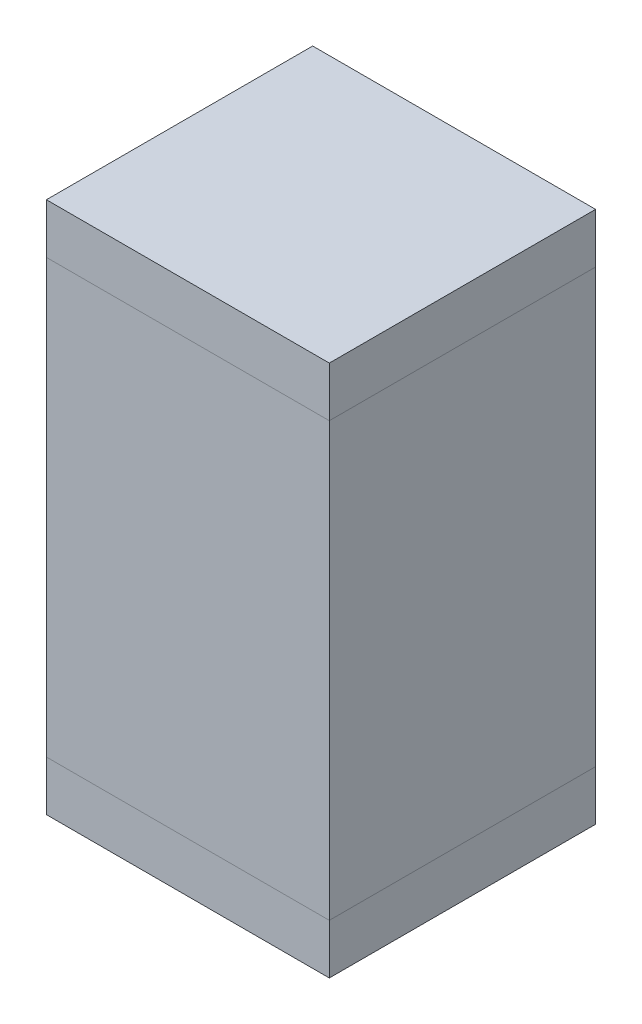
ISO-10303-21;
HEADER;
FILE_DESCRIPTION(('STEP AP214'),'2;1');
FILE_NAME('part.step','',(''),(''),'','','');
FILE_SCHEMA(('AUTOMOTIVE_DESIGN { 1 0 10303 214 1 1 1 1 }'));
ENDSEC;
DATA;
#1=APPLICATION_CONTEXT('core data for automotive mechanical design processes');
#2=APPLICATION_PROTOCOL_DEFINITION('international standard','automotive_design',2000,#1);
#3=PRODUCT_CONTEXT('',#1,'mechanical');
#4=PRODUCT('Part','Part','',(#3));
#5=PRODUCT_RELATED_PRODUCT_CATEGORY('part','',(#4));
#6=PRODUCT_DEFINITION_FORMATION('','',#4);
#7=PRODUCT_DEFINITION_CONTEXT('part definition',#1,'design');
#8=PRODUCT_DEFINITION('design','',#6,#7);
#9=PRODUCT_DEFINITION_SHAPE('','',#8);
#10=(LENGTH_UNIT() NAMED_UNIT(*) SI_UNIT(.MILLI.,.METRE.));
#11=(NAMED_UNIT(*) PLANE_ANGLE_UNIT() SI_UNIT($,.RADIAN.));
#12=(NAMED_UNIT(*) SI_UNIT($,.STERADIAN.) SOLID_ANGLE_UNIT());
#13=UNCERTAINTY_MEASURE_WITH_UNIT(LENGTH_MEASURE(1.E-05),#10,'distance_accuracy_value','');
#14=(GEOMETRIC_REPRESENTATION_CONTEXT(3) GLOBAL_UNCERTAINTY_ASSIGNED_CONTEXT((#13)) GLOBAL_UNIT_ASSIGNED_CONTEXT((#10,
#11,#12)) REPRESENTATION_CONTEXT('',''));
#15=CARTESIAN_POINT('',(0.,0.,0.));
#16=DIRECTION('',(0.,0.,1.));
#17=DIRECTION('',(1.,0.,0.));
#18=AXIS2_PLACEMENT_3D('',#15,#16,#17);
#19=CARTESIAN_POINT('',(0.,0.,0.));
#20=DIRECTION('',(0.,0.,1.));
#21=DIRECTION('',(1.,0.,0.));
#22=AXIS2_PLACEMENT_3D('',#19,#20,#21);
#23=PLANE('',#22);
#24=DIRECTION('',(1.,0.,0.));
#25=VECTOR('',#24,1.);
#26=CARTESIAN_POINT('',(-0.425,0.65,0.));
#27=LINE('',#26,#25);
#28=CARTESIAN_POINT('',(-0.425,0.65,0.));
#29=VERTEX_POINT('',#28);
#30=CARTESIAN_POINT('',(0.425,0.65,0.));
#31=VERTEX_POINT('',#30);
#32=EDGE_CURVE('P0_E26',#29,#31,#27,.T.);
#33=ORIENTED_EDGE('',*,*,#32,.T.);
#34=DIRECTION('',(0.,-1.,0.));
#35=VECTOR('',#34,1.);
#36=CARTESIAN_POINT('',(0.425,0.65,0.));
#37=LINE('',#36,#35);
#38=CARTESIAN_POINT('',(0.425,-0.65,0.));
#39=VERTEX_POINT('',#38);
#40=EDGE_CURVE('P0_E87',#31,#39,#37,.T.);
#41=ORIENTED_EDGE('',*,*,#40,.T.);
#42=DIRECTION('',(-1.,0.,0.));
#43=VECTOR('',#42,1.);
#44=CARTESIAN_POINT('',(0.425,-0.65,0.));
#45=LINE('',#44,#43);
#46=CARTESIAN_POINT('',(-0.425,-0.65,0.));
#47=VERTEX_POINT('',#46);
#48=EDGE_CURVE('P0_E80',#39,#47,#45,.T.);
#49=ORIENTED_EDGE('',*,*,#48,.T.);
#50=DIRECTION('',(0.,1.,0.));
#51=VECTOR('',#50,1.);
#52=CARTESIAN_POINT('',(-0.425,-0.65,0.));
#53=LINE('',#52,#51);
#54=EDGE_CURVE('P0_E65',#47,#29,#53,.T.);
#55=ORIENTED_EDGE('',*,*,#54,.T.);
#56=EDGE_LOOP('',(#33,#41,#49,#55));
#57=FACE_BOUND('',#56,.T.);
#58=ADVANCED_FACE('P0_F17',(#57),#23,.F.);
#59=CARTESIAN_POINT('',(0.,0.,0.8));
#60=DIRECTION('',(0.,0.,1.));
#61=DIRECTION('',(1.,0.,0.));
#62=AXIS2_PLACEMENT_3D('',#59,#60,#61);
#63=PLANE('',#62);
#64=DIRECTION('',(-1.,0.,0.));
#65=VECTOR('',#64,1.);
#66=CARTESIAN_POINT('',(-0.425,0.65,0.8));
#67=LINE('',#66,#65);
#68=CARTESIAN_POINT('',(0.425,0.65,0.8));
#69=VERTEX_POINT('',#68);
#70=CARTESIAN_POINT('',(-0.425,0.65,0.8));
#71=VERTEX_POINT('',#70);
#72=EDGE_CURVE('P0_E11',#69,#71,#67,.T.);
#73=ORIENTED_EDGE('',*,*,#72,.T.);
#74=DIRECTION('',(0.,-1.,0.));
#75=VECTOR('',#74,1.);
#76=CARTESIAN_POINT('',(-0.425,-0.65,0.8));
#77=LINE('',#76,#75);
#78=CARTESIAN_POINT('',(-0.425,-0.65,0.8));
#79=VERTEX_POINT('',#78);
#80=EDGE_CURVE('P0_E75',#71,#79,#77,.T.);
#81=ORIENTED_EDGE('',*,*,#80,.T.);
#82=DIRECTION('',(1.,0.,0.));
#83=VECTOR('',#82,1.);
#84=CARTESIAN_POINT('',(0.425,-0.65,0.8));
#85=LINE('',#84,#83);
#86=CARTESIAN_POINT('',(0.425,-0.65,0.8));
#87=VERTEX_POINT('',#86);
#88=EDGE_CURVE('P0_E82',#79,#87,#85,.T.);
#89=ORIENTED_EDGE('',*,*,#88,.T.);
#90=DIRECTION('',(0.,1.,0.));
#91=VECTOR('',#90,1.);
#92=CARTESIAN_POINT('',(0.425,0.65,0.8));
#93=LINE('',#92,#91);
#94=EDGE_CURVE('P0_E95',#87,#69,#93,.T.);
#95=ORIENTED_EDGE('',*,*,#94,.T.);
#96=EDGE_LOOP('',(#73,#81,#89,#95));
#97=FACE_BOUND('',#96,.T.);
#98=ADVANCED_FACE('P0_F119',(#97),#63,.T.);
#99=CARTESIAN_POINT('',(0.425,0.65,0.));
#100=DIRECTION('',(0.,1.,0.));
#101=DIRECTION('',(1.,0.,0.));
#102=AXIS2_PLACEMENT_3D('',#99,#100,#101);
#103=PLANE('',#102);
#104=ORIENTED_EDGE('',*,*,#32,.F.);
#105=DIRECTION('',(0.,0.,1.));
#106=VECTOR('',#105,1.);
#107=CARTESIAN_POINT('',(-0.425,0.65,0.));
#108=LINE('',#107,#106);
#109=EDGE_CURVE('P0_E71',#29,#71,#108,.T.);
#110=ORIENTED_EDGE('',*,*,#109,.T.);
#111=ORIENTED_EDGE('',*,*,#72,.F.);
#112=DIRECTION('',(0.,0.,1.));
#113=VECTOR('',#112,1.);
#114=CARTESIAN_POINT('',(0.425,0.65,0.));
#115=LINE('',#114,#113);
#116=EDGE_CURVE('P0_E105',#31,#69,#115,.T.);
#117=ORIENTED_EDGE('',*,*,#116,.F.);
#118=EDGE_LOOP('',(#104,#110,#111,#117));
#119=FACE_BOUND('',#118,.T.);
#120=ADVANCED_FACE('P0_F106',(#119),#103,.T.);
#121=CARTESIAN_POINT('',(-0.425,0.65,0.));
#122=DIRECTION('',(-1.,0.,0.));
#123=DIRECTION('',(0.,0.,1.));
#124=AXIS2_PLACEMENT_3D('',#121,#122,#123);
#125=PLANE('',#124);
#126=ORIENTED_EDGE('',*,*,#54,.F.);
#127=DIRECTION('',(0.,0.,1.));
#128=VECTOR('',#127,1.);
#129=CARTESIAN_POINT('',(-0.425,-0.65,0.));
#130=LINE('',#129,#128);
#131=EDGE_CURVE('P0_E69',#47,#79,#130,.T.);
#132=ORIENTED_EDGE('',*,*,#131,.T.);
#133=ORIENTED_EDGE('',*,*,#80,.F.);
#134=ORIENTED_EDGE('',*,*,#109,.F.);
#135=EDGE_LOOP('',(#126,#132,#133,#134));
#136=FACE_BOUND('',#135,.T.);
#137=ADVANCED_FACE('P0_F67',(#136),#125,.T.);
#138=CARTESIAN_POINT('',(-0.425,-0.65,0.));
#139=DIRECTION('',(0.,-1.,0.));
#140=DIRECTION('',(0.,0.,-1.));
#141=AXIS2_PLACEMENT_3D('',#138,#139,#140);
#142=PLANE('',#141);
#143=ORIENTED_EDGE('',*,*,#48,.F.);
#144=DIRECTION('',(0.,0.,1.));
#145=VECTOR('',#144,1.);
#146=CARTESIAN_POINT('',(0.425,-0.65,0.));
#147=LINE('',#146,#145);
#148=EDGE_CURVE('P0_E89',#39,#87,#147,.T.);
#149=ORIENTED_EDGE('',*,*,#148,.T.);
#150=ORIENTED_EDGE('',*,*,#88,.F.);
#151=ORIENTED_EDGE('',*,*,#131,.F.);
#152=EDGE_LOOP('',(#143,#149,#150,#151));
#153=FACE_BOUND('',#152,.T.);
#154=ADVANCED_FACE('P0_F78',(#153),#142,.T.);
#155=CARTESIAN_POINT('',(0.425,-0.65,0.));
#156=DIRECTION('',(1.,0.,0.));
#157=DIRECTION('',(0.,1.,0.));
#158=AXIS2_PLACEMENT_3D('',#155,#156,#157);
#159=PLANE('',#158);
#160=ORIENTED_EDGE('',*,*,#40,.F.);
#161=ORIENTED_EDGE('',*,*,#116,.T.);
#162=ORIENTED_EDGE('',*,*,#94,.F.);
#163=ORIENTED_EDGE('',*,*,#148,.F.);
#164=EDGE_LOOP('',(#160,#161,#162,#163));
#165=FACE_BOUND('',#164,.T.);
#166=ADVANCED_FACE('P0_F111',(#165),#159,.T.);
#167=CLOSED_SHELL('',(#58,#98,#120,#137,#154,#166));
#168=MANIFOLD_SOLID_BREP('P0_B1',#167);
#169=CARTESIAN_POINT('',(0.425,0.65,0.));
#170=DIRECTION('',(0.,1.,0.));
#171=DIRECTION('',(1.,0.,0.));
#172=AXIS2_PLACEMENT_3D('',#169,#170,#171);
#173=PLANE('',#172);
#174=DIRECTION('',(1.,0.,0.));
#175=VECTOR('',#174,1.);
#176=CARTESIAN_POINT('',(-0.425,0.65,0.));
#177=LINE('',#176,#175);
#178=CARTESIAN_POINT('',(-0.425,0.65,0.));
#179=VERTEX_POINT('',#178);
#180=CARTESIAN_POINT('',(0.425,0.65,0.));
#181=VERTEX_POINT('',#180);
#182=EDGE_CURVE('P1_E26',#179,#181,#177,.T.);
#183=ORIENTED_EDGE('',*,*,#182,.T.);
#184=DIRECTION('',(0.,0.,1.));
#185=VECTOR('',#184,1.);
#186=CARTESIAN_POINT('',(0.425,0.65,0.));
#187=LINE('',#186,#185);
#188=CARTESIAN_POINT('',(0.425,0.65,0.8));
#189=VERTEX_POINT('',#188);
#190=EDGE_CURVE('P1_E97',#181,#189,#187,.T.);
#191=ORIENTED_EDGE('',*,*,#190,.T.);
#192=DIRECTION('',(-1.,0.,0.));
#193=VECTOR('',#192,1.);
#194=CARTESIAN_POINT('',(-0.425,0.65,0.8));
#195=LINE('',#194,#193);
#196=CARTESIAN_POINT('',(-0.425,0.65,0.8));
#197=VERTEX_POINT('',#196);
#198=EDGE_CURVE('P1_E80',#189,#197,#195,.T.);
#199=ORIENTED_EDGE('',*,*,#198,.T.);
#200=DIRECTION('',(0.,0.,1.));
#201=VECTOR('',#200,1.);
#202=CARTESIAN_POINT('',(-0.425,0.65,0.));
#203=LINE('',#202,#201);
#204=EDGE_CURVE('P1_E103',#179,#197,#203,.T.);
#205=ORIENTED_EDGE('',*,*,#204,.F.);
#206=EDGE_LOOP('',(#183,#191,#199,#205));
#207=FACE_BOUND('',#206,.T.);
#208=ADVANCED_FACE('P1_F17',(#207),#173,.F.);
#209=CARTESIAN_POINT('',(0.425,0.8,0.));
#210=DIRECTION('',(0.,1.,0.));
#211=DIRECTION('',(1.,0.,0.));
#212=AXIS2_PLACEMENT_3D('',#209,#210,#211);
#213=PLANE('',#212);
#214=DIRECTION('',(-1.,0.,0.));
#215=VECTOR('',#214,1.);
#216=CARTESIAN_POINT('',(-0.425,0.8,0.));
#217=LINE('',#216,#215);
#218=CARTESIAN_POINT('',(0.425,0.8,0.));
#219=VERTEX_POINT('',#218);
#220=CARTESIAN_POINT('',(-0.425,0.8,0.));
#221=VERTEX_POINT('',#220);
#222=EDGE_CURVE('P1_E11',#219,#221,#217,.T.);
#223=ORIENTED_EDGE('',*,*,#222,.T.);
#224=DIRECTION('',(0.,0.,1.));
#225=VECTOR('',#224,1.);
#226=CARTESIAN_POINT('',(-0.425,0.8,0.));
#227=LINE('',#226,#225);
#228=CARTESIAN_POINT('',(-0.425,0.8,0.8));
#229=VERTEX_POINT('',#228);
#230=EDGE_CURVE('P1_E74',#221,#229,#227,.T.);
#231=ORIENTED_EDGE('',*,*,#230,.T.);
#232=DIRECTION('',(1.,0.,0.));
#233=VECTOR('',#232,1.);
#234=CARTESIAN_POINT('',(-0.425,0.8,0.8));
#235=LINE('',#234,#233);
#236=CARTESIAN_POINT('',(0.425,0.8,0.8));
#237=VERTEX_POINT('',#236);
#238=EDGE_CURVE('P1_E68',#229,#237,#235,.T.);
#239=ORIENTED_EDGE('',*,*,#238,.T.);
#240=DIRECTION('',(0.,0.,-1.));
#241=VECTOR('',#240,1.);
#242=CARTESIAN_POINT('',(0.425,0.8,0.));
#243=LINE('',#242,#241);
#244=EDGE_CURVE('P1_E71',#237,#219,#243,.T.);
#245=ORIENTED_EDGE('',*,*,#244,.T.);
#246=EDGE_LOOP('',(#223,#231,#239,#245));
#247=FACE_BOUND('',#246,.T.);
#248=ADVANCED_FACE('P1_F19',(#247),#213,.T.);
#249=CARTESIAN_POINT('',(0.425,0.65,0.));
#250=DIRECTION('',(0.,0.,-1.));
#251=DIRECTION('',(0.,-1.,0.));
#252=AXIS2_PLACEMENT_3D('',#249,#250,#251);
#253=PLANE('',#252);
#254=ORIENTED_EDGE('',*,*,#182,.F.);
#255=DIRECTION('',(0.,1.,0.));
#256=VECTOR('',#255,1.);
#257=CARTESIAN_POINT('',(-0.425,0.65,0.));
#258=LINE('',#257,#256);
#259=EDGE_CURVE('P1_E108',#179,#221,#258,.T.);
#260=ORIENTED_EDGE('',*,*,#259,.T.);
#261=ORIENTED_EDGE('',*,*,#222,.F.);
#262=DIRECTION('',(0.,1.,0.));
#263=VECTOR('',#262,1.);
#264=CARTESIAN_POINT('',(0.425,0.65,0.));
#265=LINE('',#264,#263);
#266=EDGE_CURVE('P1_E92',#181,#219,#265,.T.);
#267=ORIENTED_EDGE('',*,*,#266,.F.);
#268=EDGE_LOOP('',(#254,#260,#261,#267));
#269=FACE_BOUND('',#268,.T.);
#270=ADVANCED_FACE('P1_F114',(#269),#253,.T.);
#271=CARTESIAN_POINT('',(-0.425,0.65,0.));
#272=DIRECTION('',(-1.,0.,0.));
#273=DIRECTION('',(0.,0.,1.));
#274=AXIS2_PLACEMENT_3D('',#271,#272,#273);
#275=PLANE('',#274);
#276=ORIENTED_EDGE('',*,*,#204,.T.);
#277=DIRECTION('',(0.,1.,0.));
#278=VECTOR('',#277,1.);
#279=CARTESIAN_POINT('',(-0.425,0.65,0.8));
#280=LINE('',#279,#278);
#281=EDGE_CURVE('P1_E79',#197,#229,#280,.T.);
#282=ORIENTED_EDGE('',*,*,#281,.T.);
#283=ORIENTED_EDGE('',*,*,#230,.F.);
#284=ORIENTED_EDGE('',*,*,#259,.F.);
#285=EDGE_LOOP('',(#276,#282,#283,#284));
#286=FACE_BOUND('',#285,.T.);
#287=ADVANCED_FACE('P1_F121',(#286),#275,.T.);
#288=CARTESIAN_POINT('',(-0.425,0.65,0.8));
#289=DIRECTION('',(0.,0.,1.));
#290=DIRECTION('',(1.,0.,0.));
#291=AXIS2_PLACEMENT_3D('',#288,#289,#290);
#292=PLANE('',#291);
#293=ORIENTED_EDGE('',*,*,#198,.F.);
#294=DIRECTION('',(0.,1.,0.));
#295=VECTOR('',#294,1.);
#296=CARTESIAN_POINT('',(0.425,0.65,0.8));
#297=LINE('',#296,#295);
#298=EDGE_CURVE('P1_E83',#189,#237,#297,.T.);
#299=ORIENTED_EDGE('',*,*,#298,.T.);
#300=ORIENTED_EDGE('',*,*,#238,.F.);
#301=ORIENTED_EDGE('',*,*,#281,.F.);
#302=EDGE_LOOP('',(#293,#299,#300,#301));
#303=FACE_BOUND('',#302,.T.);
#304=ADVANCED_FACE('P1_F84',(#303),#292,.T.);
#305=CARTESIAN_POINT('',(0.425,0.65,0.8));
#306=DIRECTION('',(1.,0.,0.));
#307=DIRECTION('',(0.,1.,0.));
#308=AXIS2_PLACEMENT_3D('',#305,#306,#307);
#309=PLANE('',#308);
#310=ORIENTED_EDGE('',*,*,#190,.F.);
#311=ORIENTED_EDGE('',*,*,#266,.T.);
#312=ORIENTED_EDGE('',*,*,#244,.F.);
#313=ORIENTED_EDGE('',*,*,#298,.F.);
#314=EDGE_LOOP('',(#310,#311,#312,#313));
#315=FACE_BOUND('',#314,.T.);
#316=ADVANCED_FACE('P1_F91',(#315),#309,.T.);
#317=CLOSED_SHELL('',(#208,#248,#270,#287,#304,#316));
#318=MANIFOLD_SOLID_BREP('P1_B1',#317);
#319=CARTESIAN_POINT('',(-0.425,-0.65,0.));
#320=DIRECTION('',(0.,-1.,0.));
#321=DIRECTION('',(0.,0.,-1.));
#322=AXIS2_PLACEMENT_3D('',#319,#320,#321);
#323=PLANE('',#322);
#324=DIRECTION('',(-1.,0.,0.));
#325=VECTOR('',#324,1.);
#326=CARTESIAN_POINT('',(0.425,-0.65,0.));
#327=LINE('',#326,#325);
#328=CARTESIAN_POINT('',(0.425,-0.65,0.));
#329=VERTEX_POINT('',#328);
#330=CARTESIAN_POINT('',(-0.425,-0.65,0.));
#331=VERTEX_POINT('',#330);
#332=EDGE_CURVE('P2_E25',#329,#331,#327,.T.);
#333=ORIENTED_EDGE('',*,*,#332,.T.);
#334=DIRECTION('',(0.,0.,1.));
#335=VECTOR('',#334,1.);
#336=CARTESIAN_POINT('',(-0.425,-0.65,0.));
#337=LINE('',#336,#335);
#338=CARTESIAN_POINT('',(-0.425,-0.65,0.8));
#339=VERTEX_POINT('',#338);
#340=EDGE_CURVE('P2_E71',#331,#339,#337,.T.);
#341=ORIENTED_EDGE('',*,*,#340,.T.);
#342=DIRECTION('',(1.,0.,0.));
#343=VECTOR('',#342,1.);
#344=CARTESIAN_POINT('',(0.425,-0.65,0.8));
#345=LINE('',#344,#343);
#346=CARTESIAN_POINT('',(0.425,-0.65,0.8));
#347=VERTEX_POINT('',#346);
#348=EDGE_CURVE('P2_E95',#339,#347,#345,.T.);
#349=ORIENTED_EDGE('',*,*,#348,.T.);
#350=DIRECTION('',(0.,0.,1.));
#351=VECTOR('',#350,1.);
#352=CARTESIAN_POINT('',(0.425,-0.65,0.));
#353=LINE('',#352,#351);
#354=EDGE_CURVE('P2_E72',#329,#347,#353,.T.);
#355=ORIENTED_EDGE('',*,*,#354,.F.);
#356=EDGE_LOOP('',(#333,#341,#349,#355));
#357=FACE_BOUND('',#356,.T.);
#358=ADVANCED_FACE('P2_F17',(#357),#323,.F.);
#359=CARTESIAN_POINT('',(-0.425,-0.8,0.));
#360=DIRECTION('',(0.,-1.,0.));
#361=DIRECTION('',(0.,0.,-1.));
#362=AXIS2_PLACEMENT_3D('',#359,#360,#361);
#363=PLANE('',#362);
#364=DIRECTION('',(1.,0.,0.));
#365=VECTOR('',#364,1.);
#366=CARTESIAN_POINT('',(0.425,-0.8,0.));
#367=LINE('',#366,#365);
#368=CARTESIAN_POINT('',(-0.425,-0.8,0.));
#369=VERTEX_POINT('',#368);
#370=CARTESIAN_POINT('',(0.425,-0.8,0.));
#371=VERTEX_POINT('',#370);
#372=EDGE_CURVE('P2_E11',#369,#371,#367,.T.);
#373=ORIENTED_EDGE('',*,*,#372,.T.);
#374=DIRECTION('',(0.,0.,1.));
#375=VECTOR('',#374,1.);
#376=CARTESIAN_POINT('',(0.425,-0.8,0.));
#377=LINE('',#376,#375);
#378=CARTESIAN_POINT('',(0.425,-0.8,0.8));
#379=VERTEX_POINT('',#378);
#380=EDGE_CURVE('P2_E102',#371,#379,#377,.T.);
#381=ORIENTED_EDGE('',*,*,#380,.T.);
#382=DIRECTION('',(-1.,0.,0.));
#383=VECTOR('',#382,1.);
#384=CARTESIAN_POINT('',(0.425,-0.8,0.8));
#385=LINE('',#384,#383);
#386=CARTESIAN_POINT('',(-0.425,-0.8,0.8));
#387=VERTEX_POINT('',#386);
#388=EDGE_CURVE('P2_E93',#379,#387,#385,.T.);
#389=ORIENTED_EDGE('',*,*,#388,.T.);
#390=DIRECTION('',(0.,0.,-1.));
#391=VECTOR('',#390,1.);
#392=CARTESIAN_POINT('',(-0.425,-0.8,0.));
#393=LINE('',#392,#391);
#394=EDGE_CURVE('P2_E82',#387,#369,#393,.T.);
#395=ORIENTED_EDGE('',*,*,#394,.T.);
#396=EDGE_LOOP('',(#373,#381,#389,#395));
#397=FACE_BOUND('',#396,.T.);
#398=ADVANCED_FACE('P2_F117',(#397),#363,.T.);
#399=CARTESIAN_POINT('',(-0.425,-0.65,0.));
#400=DIRECTION('',(0.,0.,-1.));
#401=DIRECTION('',(0.,-1.,0.));
#402=AXIS2_PLACEMENT_3D('',#399,#400,#401);
#403=PLANE('',#402);
#404=ORIENTED_EDGE('',*,*,#332,.F.);
#405=DIRECTION('',(0.,-1.,0.));
#406=VECTOR('',#405,1.);
#407=CARTESIAN_POINT('',(0.425,-0.65,0.));
#408=LINE('',#407,#406);
#409=EDGE_CURVE('P2_E74',#329,#371,#408,.T.);
#410=ORIENTED_EDGE('',*,*,#409,.T.);
#411=ORIENTED_EDGE('',*,*,#372,.F.);
#412=DIRECTION('',(0.,-1.,0.));
#413=VECTOR('',#412,1.);
#414=CARTESIAN_POINT('',(-0.425,-0.65,0.));
#415=LINE('',#414,#413);
#416=EDGE_CURVE('P2_E77',#331,#369,#415,.T.);
#417=ORIENTED_EDGE('',*,*,#416,.F.);
#418=EDGE_LOOP('',(#404,#410,#411,#417));
#419=FACE_BOUND('',#418,.T.);
#420=ADVANCED_FACE('P2_F78',(#419),#403,.T.);
#421=CARTESIAN_POINT('',(0.425,-0.65,0.));
#422=DIRECTION('',(1.,0.,0.));
#423=DIRECTION('',(0.,1.,0.));
#424=AXIS2_PLACEMENT_3D('',#421,#422,#423);
#425=PLANE('',#424);
#426=ORIENTED_EDGE('',*,*,#354,.T.);
#427=DIRECTION('',(0.,-1.,0.));
#428=VECTOR('',#427,1.);
#429=CARTESIAN_POINT('',(0.425,-0.65,0.8));
#430=LINE('',#429,#428);
#431=EDGE_CURVE('P2_E105',#347,#379,#430,.T.);
#432=ORIENTED_EDGE('',*,*,#431,.T.);
#433=ORIENTED_EDGE('',*,*,#380,.F.);
#434=ORIENTED_EDGE('',*,*,#409,.F.);
#435=EDGE_LOOP('',(#426,#432,#433,#434));
#436=FACE_BOUND('',#435,.T.);
#437=ADVANCED_FACE('P2_F114',(#436),#425,.T.);
#438=CARTESIAN_POINT('',(0.425,-0.65,0.8));
#439=DIRECTION('',(0.,0.,1.));
#440=DIRECTION('',(1.,0.,0.));
#441=AXIS2_PLACEMENT_3D('',#438,#439,#440);
#442=PLANE('',#441);
#443=ORIENTED_EDGE('',*,*,#348,.F.);
#444=DIRECTION('',(0.,-1.,0.));
#445=VECTOR('',#444,1.);
#446=CARTESIAN_POINT('',(-0.425,-0.65,0.8));
#447=LINE('',#446,#445);
#448=EDGE_CURVE('P2_E87',#339,#387,#447,.T.);
#449=ORIENTED_EDGE('',*,*,#448,.T.);
#450=ORIENTED_EDGE('',*,*,#388,.F.);
#451=ORIENTED_EDGE('',*,*,#431,.F.);
#452=EDGE_LOOP('',(#443,#449,#450,#451));
#453=FACE_BOUND('',#452,.T.);
#454=ADVANCED_FACE('P2_F119',(#453),#442,.T.);
#455=CARTESIAN_POINT('',(-0.425,-0.65,0.8));
#456=DIRECTION('',(-1.,0.,0.));
#457=DIRECTION('',(0.,0.,1.));
#458=AXIS2_PLACEMENT_3D('',#455,#456,#457);
#459=PLANE('',#458);
#460=ORIENTED_EDGE('',*,*,#340,.F.);
#461=ORIENTED_EDGE('',*,*,#416,.T.);
#462=ORIENTED_EDGE('',*,*,#394,.F.);
#463=ORIENTED_EDGE('',*,*,#448,.F.);
#464=EDGE_LOOP('',(#460,#461,#462,#463));
#465=FACE_BOUND('',#464,.T.);
#466=ADVANCED_FACE('P2_F85',(#465),#459,.T.);
#467=CLOSED_SHELL('',(#358,#398,#420,#437,#454,#466));
#468=MANIFOLD_SOLID_BREP('P2_B1',#467);
#469=ADVANCED_BREP_SHAPE_REPRESENTATION('',(#18,#168,#318,#468),#14);
#470=SHAPE_DEFINITION_REPRESENTATION(#9,#469);
ENDSEC;
END-ISO-10303-21;
